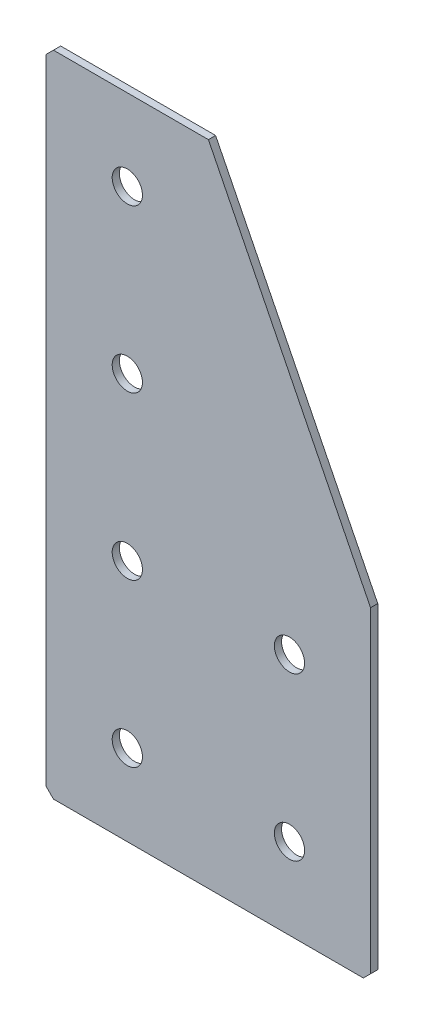
ISO-10303-21;
HEADER;
FILE_DESCRIPTION(('STEP AP214'),'2;1');
FILE_NAME('part.step','',(''),(''),'','','');
FILE_SCHEMA(('AUTOMOTIVE_DESIGN { 1 0 10303 214 1 1 1 1 }'));
ENDSEC;
DATA;
#1=APPLICATION_CONTEXT('core data for automotive mechanical design processes');
#2=APPLICATION_PROTOCOL_DEFINITION('international standard','automotive_design',2000,#1);
#3=PRODUCT_CONTEXT('',#1,'mechanical');
#4=PRODUCT('Part','Part','',(#3));
#5=PRODUCT_RELATED_PRODUCT_CATEGORY('part','',(#4));
#6=PRODUCT_DEFINITION_FORMATION('','',#4);
#7=PRODUCT_DEFINITION_CONTEXT('part definition',#1,'design');
#8=PRODUCT_DEFINITION('design','',#6,#7);
#9=PRODUCT_DEFINITION_SHAPE('','',#8);
#10=(LENGTH_UNIT() NAMED_UNIT(*) SI_UNIT(.MILLI.,.METRE.));
#11=(NAMED_UNIT(*) PLANE_ANGLE_UNIT() SI_UNIT($,.RADIAN.));
#12=(NAMED_UNIT(*) SI_UNIT($,.STERADIAN.) SOLID_ANGLE_UNIT());
#13=UNCERTAINTY_MEASURE_WITH_UNIT(LENGTH_MEASURE(1.E-05),#10,'distance_accuracy_value','');
#14=(GEOMETRIC_REPRESENTATION_CONTEXT(3) GLOBAL_UNCERTAINTY_ASSIGNED_CONTEXT((#13)) GLOBAL_UNIT_ASSIGNED_CONTEXT((#10,
#11,#12)) REPRESENTATION_CONTEXT('',''));
#15=CARTESIAN_POINT('',(0.,0.,0.));
#16=DIRECTION('',(0.,0.,1.));
#17=DIRECTION('',(1.,0.,0.));
#18=AXIS2_PLACEMENT_3D('',#15,#16,#17);
#19=CARTESIAN_POINT('',(0.,0.,-2.));
#20=DIRECTION('',(0.,0.,1.));
#21=DIRECTION('',(1.,0.,0.));
#22=AXIS2_PLACEMENT_3D('',#19,#20,#21);
#23=PLANE('',#22);
#24=CARTESIAN_POINT('',(22.5,-157.5,-2.00000000000001));
#25=DIRECTION('',(0.,0.,-1.));
#26=DIRECTION('',(0.,1.,0.));
#27=AXIS2_PLACEMENT_3D('',#24,#25,#26);
#28=CIRCLE('',#27,4.2);
#29=CARTESIAN_POINT('',(22.5,-153.3,-2.00000000000001));
#30=VERTEX_POINT('',#29);
#31=EDGE_CURVE('E206',#30,#30,#28,.T.);
#32=ORIENTED_EDGE('',*,*,#31,.F.);
#33=EDGE_LOOP('',(#32));
#34=FACE_BOUND('',#33,.T.);
#35=CARTESIAN_POINT('',(22.5,-67.5,-2.));
#36=DIRECTION('',(0.,0.,-1.));
#37=DIRECTION('',(0.,1.,0.));
#38=AXIS2_PLACEMENT_3D('',#35,#36,#37);
#39=CIRCLE('',#38,4.2);
#40=CARTESIAN_POINT('',(22.5,-63.3,-2.));
#41=VERTEX_POINT('',#40);
#42=EDGE_CURVE('E194',#41,#41,#39,.T.);
#43=ORIENTED_EDGE('',*,*,#42,.F.);
#44=EDGE_LOOP('',(#43));
#45=FACE_BOUND('',#44,.T.);
#46=CARTESIAN_POINT('',(22.5,-22.5,-2.));
#47=DIRECTION('',(0.,0.,-1.));
#48=DIRECTION('',(0.,1.,0.));
#49=AXIS2_PLACEMENT_3D('',#46,#47,#48);
#50=CIRCLE('',#49,4.2);
#51=CARTESIAN_POINT('',(22.5,-18.3,-2.));
#52=VERTEX_POINT('',#51);
#53=EDGE_CURVE('E188',#52,#52,#50,.T.);
#54=ORIENTED_EDGE('',*,*,#53,.F.);
#55=EDGE_LOOP('',(#54));
#56=FACE_BOUND('',#55,.T.);
#57=CARTESIAN_POINT('',(67.5,-157.5,-2.00000000000001));
#58=DIRECTION('',(0.,0.,-1.));
#59=DIRECTION('',(0.,1.,0.));
#60=AXIS2_PLACEMENT_3D('',#57,#58,#59);
#61=CIRCLE('',#60,4.2);
#62=CARTESIAN_POINT('',(67.5,-153.3,-2.00000000000001));
#63=VERTEX_POINT('',#62);
#64=EDGE_CURVE('E182',#63,#63,#61,.T.);
#65=ORIENTED_EDGE('',*,*,#64,.F.);
#66=EDGE_LOOP('',(#65));
#67=FACE_BOUND('',#66,.T.);
#68=CARTESIAN_POINT('',(67.5,-112.5,-2.00000000000001));
#69=DIRECTION('',(0.,0.,-1.));
#70=DIRECTION('',(0.,1.,0.));
#71=AXIS2_PLACEMENT_3D('',#68,#69,#70);
#72=CIRCLE('',#71,4.2);
#73=CARTESIAN_POINT('',(67.5,-108.3,-2.00000000000001));
#74=VERTEX_POINT('',#73);
#75=EDGE_CURVE('E176',#74,#74,#72,.T.);
#76=ORIENTED_EDGE('',*,*,#75,.F.);
#77=EDGE_LOOP('',(#76));
#78=FACE_BOUND('',#77,.T.);
#79=DIRECTION('',(0.,1.,0.));
#80=VECTOR('',#79,1.);
#81=CARTESIAN_POINT('',(0.,0.,-2.));
#82=LINE('',#81,#80);
#83=CARTESIAN_POINT('',(0.,-178.,-2.));
#84=VERTEX_POINT('',#83);
#85=CARTESIAN_POINT('',(0.,-2.,-2.));
#86=VERTEX_POINT('',#85);
#87=EDGE_CURVE('E132',#84,#86,#82,.T.);
#88=ORIENTED_EDGE('',*,*,#87,.T.);
#89=DIRECTION('',(-0.707106781186548,-0.707106781186548,0.));
#90=VECTOR('',#89,1.);
#91=CARTESIAN_POINT('',(2.,0.,-2.));
#92=LINE('',#91,#90);
#93=CARTESIAN_POINT('',(2.00000000000002,0.,-2.));
#94=VERTEX_POINT('',#93);
#95=EDGE_CURVE('E108',#86,#94,#92,.F.);
#96=ORIENTED_EDGE('',*,*,#95,.T.);
#97=DIRECTION('',(1.,0.,0.));
#98=VECTOR('',#97,1.);
#99=CARTESIAN_POINT('',(45.,0.,-2.));
#100=LINE('',#99,#98);
#101=CARTESIAN_POINT('',(45.,0.,-2.));
#102=VERTEX_POINT('',#101);
#103=EDGE_CURVE('E101',#94,#102,#100,.T.);
#104=ORIENTED_EDGE('',*,*,#103,.T.);
#105=DIRECTION('',(0.447213595499958,-0.894427190999916,0.));
#106=VECTOR('',#105,1.);
#107=CARTESIAN_POINT('',(90.,-90.,-2.));
#108=LINE('',#107,#106);
#109=CARTESIAN_POINT('',(90.,-90.,-2.));
#110=VERTEX_POINT('',#109);
#111=EDGE_CURVE('E105',#102,#110,#108,.T.);
#112=ORIENTED_EDGE('',*,*,#111,.T.);
#113=DIRECTION('',(0.,-1.,0.));
#114=VECTOR('',#113,1.);
#115=CARTESIAN_POINT('',(90.,-180.,-2.));
#116=LINE('',#115,#114);
#117=CARTESIAN_POINT('',(90.,-178.,-2.));
#118=VERTEX_POINT('',#117);
#119=EDGE_CURVE('E122',#110,#118,#116,.T.);
#120=ORIENTED_EDGE('',*,*,#119,.T.);
#121=DIRECTION('',(0.707106781186548,0.707106781186548,0.));
#122=VECTOR('',#121,1.);
#123=CARTESIAN_POINT('',(88.,-180.,-2.));
#124=LINE('',#123,#122);
#125=CARTESIAN_POINT('',(87.9999999999999,-180.,-2.));
#126=VERTEX_POINT('',#125);
#127=EDGE_CURVE('E59',#118,#126,#124,.F.);
#128=ORIENTED_EDGE('',*,*,#127,.T.);
#129=DIRECTION('',(-1.,0.,0.));
#130=VECTOR('',#129,1.);
#131=CARTESIAN_POINT('',(0.,-180.,-2.));
#132=LINE('',#131,#130);
#133=CARTESIAN_POINT('',(2.,-180.,-2.));
#134=VERTEX_POINT('',#133);
#135=EDGE_CURVE('E155',#126,#134,#132,.T.);
#136=ORIENTED_EDGE('',*,*,#135,.T.);
#137=DIRECTION('',(0.707106781186548,-0.707106781186548,0.));
#138=VECTOR('',#137,1.);
#139=CARTESIAN_POINT('',(0.,-178.,-2.));
#140=LINE('',#139,#138);
#141=EDGE_CURVE('E146',#134,#84,#140,.F.);
#142=ORIENTED_EDGE('',*,*,#141,.T.);
#143=EDGE_LOOP('',(#88,#96,#104,#112,#120,#128,#136,#142));
#144=FACE_BOUND('',#143,.T.);
#145=CARTESIAN_POINT('',(22.5,-112.5,-2.00000000000001));
#146=DIRECTION('',(0.,0.,-1.));
#147=DIRECTION('',(0.,1.,0.));
#148=AXIS2_PLACEMENT_3D('',#145,#146,#147);
#149=CIRCLE('',#148,4.2);
#150=CARTESIAN_POINT('',(22.5,-108.3,-2.00000000000001));
#151=VERTEX_POINT('',#150);
#152=EDGE_CURVE('E200',#151,#151,#149,.T.);
#153=ORIENTED_EDGE('',*,*,#152,.F.);
#154=EDGE_LOOP('',(#153));
#155=FACE_BOUND('',#154,.T.);
#156=ADVANCED_FACE('F37',(#34,#45,#56,#67,#78,#144,#155),#23,.F.);
#157=CARTESIAN_POINT('',(45.,0.,-2.));
#158=DIRECTION('',(0.,-1.,0.));
#159=DIRECTION('',(1.,0.,0.));
#160=AXIS2_PLACEMENT_3D('',#157,#158,#159);
#161=PLANE('',#160);
#162=ORIENTED_EDGE('',*,*,#103,.F.);
#163=DIRECTION('',(0.,0.,1.));
#164=VECTOR('',#163,1.);
#165=CARTESIAN_POINT('',(2.,0.,-2.));
#166=LINE('',#165,#164);
#167=CARTESIAN_POINT('',(2.00000000000002,0.,0.));
#168=VERTEX_POINT('',#167);
#169=EDGE_CURVE('E128',#94,#168,#166,.T.);
#170=ORIENTED_EDGE('',*,*,#169,.T.);
#171=DIRECTION('',(1.,0.,0.));
#172=VECTOR('',#171,1.);
#173=CARTESIAN_POINT('',(45.,0.,0.));
#174=LINE('',#173,#172);
#175=CARTESIAN_POINT('',(45.,0.,0.));
#176=VERTEX_POINT('',#175);
#177=EDGE_CURVE('E126',#168,#176,#174,.T.);
#178=ORIENTED_EDGE('',*,*,#177,.T.);
#179=DIRECTION('',(0.,0.,1.));
#180=VECTOR('',#179,1.);
#181=CARTESIAN_POINT('',(45.,0.,-2.));
#182=LINE('',#181,#180);
#183=EDGE_CURVE('E118',#102,#176,#182,.T.);
#184=ORIENTED_EDGE('',*,*,#183,.F.);
#185=EDGE_LOOP('',(#162,#170,#178,#184));
#186=FACE_BOUND('',#185,.T.);
#187=ADVANCED_FACE('F124',(#186),#161,.F.);
#188=CARTESIAN_POINT('',(90.,-90.,-2.));
#189=DIRECTION('',(-0.894427190999916,-0.447213595499958,0.));
#190=DIRECTION('',(0.447213595499958,-0.894427190999916,0.));
#191=AXIS2_PLACEMENT_3D('',#188,#189,#190);
#192=PLANE('',#191);
#193=DIRECTION('',(0.447213595499958,-0.894427190999916,0.));
#194=VECTOR('',#193,1.);
#195=CARTESIAN_POINT('',(90.,-90.,0.));
#196=LINE('',#195,#194);
#197=CARTESIAN_POINT('',(90.,-90.,0.));
#198=VERTEX_POINT('',#197);
#199=EDGE_CURVE('E165',#176,#198,#196,.T.);
#200=ORIENTED_EDGE('',*,*,#199,.T.);
#201=DIRECTION('',(0.,0.,1.));
#202=VECTOR('',#201,1.);
#203=CARTESIAN_POINT('',(90.,-90.,-2.));
#204=LINE('',#203,#202);
#205=EDGE_CURVE('E120',#110,#198,#204,.T.);
#206=ORIENTED_EDGE('',*,*,#205,.F.);
#207=ORIENTED_EDGE('',*,*,#111,.F.);
#208=ORIENTED_EDGE('',*,*,#183,.T.);
#209=EDGE_LOOP('',(#200,#206,#207,#208));
#210=FACE_BOUND('',#209,.T.);
#211=ADVANCED_FACE('F117',(#210),#192,.F.);
#212=CARTESIAN_POINT('',(90.,-180.,-2.));
#213=DIRECTION('',(-1.,0.,0.));
#214=DIRECTION('',(0.,-1.,0.));
#215=AXIS2_PLACEMENT_3D('',#212,#213,#214);
#216=PLANE('',#215);
#217=DIRECTION('',(0.,-1.,0.));
#218=VECTOR('',#217,1.);
#219=CARTESIAN_POINT('',(90.,-180.,0.));
#220=LINE('',#219,#218);
#221=CARTESIAN_POINT('',(90.,-178.,0.));
#222=VERTEX_POINT('',#221);
#223=EDGE_CURVE('E162',#198,#222,#220,.T.);
#224=ORIENTED_EDGE('',*,*,#223,.T.);
#225=DIRECTION('',(0.,0.,-1.));
#226=VECTOR('',#225,1.);
#227=CARTESIAN_POINT('',(90.,-178.,-2.));
#228=LINE('',#227,#226);
#229=EDGE_CURVE('E11',#222,#118,#228,.T.);
#230=ORIENTED_EDGE('',*,*,#229,.T.);
#231=ORIENTED_EDGE('',*,*,#119,.F.);
#232=ORIENTED_EDGE('',*,*,#205,.T.);
#233=EDGE_LOOP('',(#224,#230,#231,#232));
#234=FACE_BOUND('',#233,.T.);
#235=ADVANCED_FACE('F245',(#234),#216,.F.);
#236=CARTESIAN_POINT('',(0.,-180.,-2.));
#237=DIRECTION('',(0.,1.,0.));
#238=DIRECTION('',(0.,0.,1.));
#239=AXIS2_PLACEMENT_3D('',#236,#237,#238);
#240=PLANE('',#239);
#241=ORIENTED_EDGE('',*,*,#135,.F.);
#242=DIRECTION('',(0.,0.,1.));
#243=VECTOR('',#242,1.);
#244=CARTESIAN_POINT('',(88.,-180.,-2.));
#245=LINE('',#244,#243);
#246=CARTESIAN_POINT('',(87.9999999999999,-180.,0.));
#247=VERTEX_POINT('',#246);
#248=EDGE_CURVE('E45',#126,#247,#245,.T.);
#249=ORIENTED_EDGE('',*,*,#248,.T.);
#250=DIRECTION('',(-1.,0.,0.));
#251=VECTOR('',#250,1.);
#252=CARTESIAN_POINT('',(0.,-180.,0.));
#253=LINE('',#252,#251);
#254=CARTESIAN_POINT('',(2.,-180.,0.));
#255=VERTEX_POINT('',#254);
#256=EDGE_CURVE('E154',#247,#255,#253,.T.);
#257=ORIENTED_EDGE('',*,*,#256,.T.);
#258=DIRECTION('',(0.,0.,-1.));
#259=VECTOR('',#258,1.);
#260=CARTESIAN_POINT('',(2.,-180.,-2.));
#261=LINE('',#260,#259);
#262=EDGE_CURVE('E52',#255,#134,#261,.T.);
#263=ORIENTED_EDGE('',*,*,#262,.T.);
#264=EDGE_LOOP('',(#241,#249,#257,#263));
#265=FACE_BOUND('',#264,.T.);
#266=ADVANCED_FACE('F153',(#265),#240,.F.);
#267=CARTESIAN_POINT('',(0.,0.,-2.));
#268=DIRECTION('',(1.,0.,0.));
#269=DIRECTION('',(0.,0.,-1.));
#270=AXIS2_PLACEMENT_3D('',#267,#268,#269);
#271=PLANE('',#270);
#272=DIRECTION('',(0.,1.,0.));
#273=VECTOR('',#272,1.);
#274=CARTESIAN_POINT('',(0.,0.,0.));
#275=LINE('',#274,#273);
#276=CARTESIAN_POINT('',(0.,-178.,0.));
#277=VERTEX_POINT('',#276);
#278=CARTESIAN_POINT('',(0.,-2.,0.));
#279=VERTEX_POINT('',#278);
#280=EDGE_CURVE('E113',#277,#279,#275,.T.);
#281=ORIENTED_EDGE('',*,*,#280,.T.);
#282=DIRECTION('',(0.,0.,-1.));
#283=VECTOR('',#282,1.);
#284=CARTESIAN_POINT('',(0.,-2.,-2.));
#285=LINE('',#284,#283);
#286=EDGE_CURVE('E144',#279,#86,#285,.T.);
#287=ORIENTED_EDGE('',*,*,#286,.T.);
#288=ORIENTED_EDGE('',*,*,#87,.F.);
#289=DIRECTION('',(0.,0.,1.));
#290=VECTOR('',#289,1.);
#291=CARTESIAN_POINT('',(0.,-178.,-2.));
#292=LINE('',#291,#290);
#293=EDGE_CURVE('E141',#84,#277,#292,.T.);
#294=ORIENTED_EDGE('',*,*,#293,.T.);
#295=EDGE_LOOP('',(#281,#287,#288,#294));
#296=FACE_BOUND('',#295,.T.);
#297=ADVANCED_FACE('F232',(#296),#271,.F.);
#298=CARTESIAN_POINT('',(0.,0.,0.));
#299=DIRECTION('',(0.,0.,1.));
#300=DIRECTION('',(1.,0.,0.));
#301=AXIS2_PLACEMENT_3D('',#298,#299,#300);
#302=PLANE('',#301);
#303=CARTESIAN_POINT('',(22.5,-157.5,0.));
#304=DIRECTION('',(0.,0.,1.));
#305=DIRECTION('',(1.,0.,0.));
#306=AXIS2_PLACEMENT_3D('',#303,#304,#305);
#307=CIRCLE('',#306,4.2);
#308=CARTESIAN_POINT('',(26.7,-157.5,0.));
#309=VERTEX_POINT('',#308);
#310=EDGE_CURVE('E203',#309,#309,#307,.T.);
#311=ORIENTED_EDGE('',*,*,#310,.F.);
#312=EDGE_LOOP('',(#311));
#313=FACE_BOUND('',#312,.T.);
#314=CARTESIAN_POINT('',(22.5,-112.5,0.));
#315=DIRECTION('',(0.,0.,1.));
#316=DIRECTION('',(1.,0.,0.));
#317=AXIS2_PLACEMENT_3D('',#314,#315,#316);
#318=CIRCLE('',#317,4.2);
#319=CARTESIAN_POINT('',(26.7,-112.5,0.));
#320=VERTEX_POINT('',#319);
#321=EDGE_CURVE('E197',#320,#320,#318,.T.);
#322=ORIENTED_EDGE('',*,*,#321,.F.);
#323=EDGE_LOOP('',(#322));
#324=FACE_BOUND('',#323,.T.);
#325=CARTESIAN_POINT('',(22.5,-67.5,0.));
#326=DIRECTION('',(0.,0.,1.));
#327=DIRECTION('',(1.,0.,0.));
#328=AXIS2_PLACEMENT_3D('',#325,#326,#327);
#329=CIRCLE('',#328,4.2);
#330=CARTESIAN_POINT('',(26.7,-67.5,0.));
#331=VERTEX_POINT('',#330);
#332=EDGE_CURVE('E191',#331,#331,#329,.T.);
#333=ORIENTED_EDGE('',*,*,#332,.F.);
#334=EDGE_LOOP('',(#333));
#335=FACE_BOUND('',#334,.T.);
#336=CARTESIAN_POINT('',(22.5,-22.5,0.));
#337=DIRECTION('',(0.,0.,1.));
#338=DIRECTION('',(1.,0.,0.));
#339=AXIS2_PLACEMENT_3D('',#336,#337,#338);
#340=CIRCLE('',#339,4.2);
#341=CARTESIAN_POINT('',(26.7,-22.5,0.));
#342=VERTEX_POINT('',#341);
#343=EDGE_CURVE('E185',#342,#342,#340,.T.);
#344=ORIENTED_EDGE('',*,*,#343,.F.);
#345=EDGE_LOOP('',(#344));
#346=FACE_BOUND('',#345,.T.);
#347=CARTESIAN_POINT('',(67.5,-157.5,0.));
#348=DIRECTION('',(0.,0.,1.));
#349=DIRECTION('',(1.,0.,0.));
#350=AXIS2_PLACEMENT_3D('',#347,#348,#349);
#351=CIRCLE('',#350,4.2);
#352=CARTESIAN_POINT('',(71.7,-157.5,0.));
#353=VERTEX_POINT('',#352);
#354=EDGE_CURVE('E179',#353,#353,#351,.T.);
#355=ORIENTED_EDGE('',*,*,#354,.F.);
#356=EDGE_LOOP('',(#355));
#357=FACE_BOUND('',#356,.T.);
#358=CARTESIAN_POINT('',(67.5,-112.5,0.));
#359=DIRECTION('',(0.,0.,1.));
#360=DIRECTION('',(1.,0.,0.));
#361=AXIS2_PLACEMENT_3D('',#358,#359,#360);
#362=CIRCLE('',#361,4.2);
#363=CARTESIAN_POINT('',(71.7,-112.5,0.));
#364=VERTEX_POINT('',#363);
#365=EDGE_CURVE('E170',#364,#364,#362,.T.);
#366=ORIENTED_EDGE('',*,*,#365,.F.);
#367=EDGE_LOOP('',(#366));
#368=FACE_BOUND('',#367,.T.);
#369=ORIENTED_EDGE('',*,*,#177,.F.);
#370=DIRECTION('',(0.707106781186548,0.707106781186548,0.));
#371=VECTOR('',#370,1.);
#372=CARTESIAN_POINT('',(1.,-1.,0.));
#373=LINE('',#372,#371);
#374=EDGE_CURVE('E139',#168,#279,#373,.F.);
#375=ORIENTED_EDGE('',*,*,#374,.T.);
#376=ORIENTED_EDGE('',*,*,#280,.F.);
#377=DIRECTION('',(-0.707106781186548,0.707106781186548,0.));
#378=VECTOR('',#377,1.);
#379=CARTESIAN_POINT('',(-89.,-89.,0.));
#380=LINE('',#379,#378);
#381=EDGE_CURVE('E130',#277,#255,#380,.F.);
#382=ORIENTED_EDGE('',*,*,#381,.T.);
#383=ORIENTED_EDGE('',*,*,#256,.F.);
#384=DIRECTION('',(-0.707106781186548,-0.707106781186548,0.));
#385=VECTOR('',#384,1.);
#386=CARTESIAN_POINT('',(134.,-134.,0.));
#387=LINE('',#386,#385);
#388=EDGE_CURVE('E137',#247,#222,#387,.F.);
#389=ORIENTED_EDGE('',*,*,#388,.T.);
#390=ORIENTED_EDGE('',*,*,#223,.F.);
#391=ORIENTED_EDGE('',*,*,#199,.F.);
#392=EDGE_LOOP('',(#369,#375,#376,#382,#383,#389,#390,#391));
#393=FACE_BOUND('',#392,.T.);
#394=ADVANCED_FACE('F158',(#313,#324,#335,#346,#357,#368,#393),#302,.T.);
#395=CARTESIAN_POINT('',(67.5,-112.5,-2.00000000000001));
#396=DIRECTION('',(0.,0.,-1.));
#397=DIRECTION('',(0.,1.,0.));
#398=AXIS2_PLACEMENT_3D('',#395,#396,#397);
#399=CYLINDRICAL_SURFACE('',#398,4.2);
#400=ORIENTED_EDGE('',*,*,#75,.T.);
#401=EDGE_LOOP('',(#400));
#402=FACE_BOUND('',#401,.T.);
#403=ORIENTED_EDGE('',*,*,#365,.T.);
#404=EDGE_LOOP('',(#403));
#405=FACE_BOUND('',#404,.T.);
#406=ADVANCED_FACE('F224',(#402,#405),#399,.F.);
#407=CARTESIAN_POINT('',(67.5,-157.5,-2.00000000000001));
#408=DIRECTION('',(0.,0.,-1.));
#409=DIRECTION('',(0.,1.,0.));
#410=AXIS2_PLACEMENT_3D('',#407,#408,#409);
#411=CYLINDRICAL_SURFACE('',#410,4.2);
#412=ORIENTED_EDGE('',*,*,#64,.T.);
#413=EDGE_LOOP('',(#412));
#414=FACE_BOUND('',#413,.T.);
#415=ORIENTED_EDGE('',*,*,#354,.T.);
#416=EDGE_LOOP('',(#415));
#417=FACE_BOUND('',#416,.T.);
#418=ADVANCED_FACE('F227',(#414,#417),#411,.F.);
#419=CARTESIAN_POINT('',(22.5,-22.5,-2.));
#420=DIRECTION('',(0.,0.,-1.));
#421=DIRECTION('',(0.,1.,0.));
#422=AXIS2_PLACEMENT_3D('',#419,#420,#421);
#423=CYLINDRICAL_SURFACE('',#422,4.2);
#424=ORIENTED_EDGE('',*,*,#53,.T.);
#425=EDGE_LOOP('',(#424));
#426=FACE_BOUND('',#425,.T.);
#427=ORIENTED_EDGE('',*,*,#343,.T.);
#428=EDGE_LOOP('',(#427));
#429=FACE_BOUND('',#428,.T.);
#430=ADVANCED_FACE('F343',(#426,#429),#423,.F.);
#431=CARTESIAN_POINT('',(22.5,-67.5,-2.));
#432=DIRECTION('',(0.,0.,-1.));
#433=DIRECTION('',(0.,1.,0.));
#434=AXIS2_PLACEMENT_3D('',#431,#432,#433);
#435=CYLINDRICAL_SURFACE('',#434,4.2);
#436=ORIENTED_EDGE('',*,*,#42,.T.);
#437=EDGE_LOOP('',(#436));
#438=FACE_BOUND('',#437,.T.);
#439=ORIENTED_EDGE('',*,*,#332,.T.);
#440=EDGE_LOOP('',(#439));
#441=FACE_BOUND('',#440,.T.);
#442=ADVANCED_FACE('F333',(#438,#441),#435,.F.);
#443=CARTESIAN_POINT('',(22.5,-112.5,-2.00000000000001));
#444=DIRECTION('',(0.,0.,-1.));
#445=DIRECTION('',(0.,1.,0.));
#446=AXIS2_PLACEMENT_3D('',#443,#444,#445);
#447=CYLINDRICAL_SURFACE('',#446,4.2);
#448=ORIENTED_EDGE('',*,*,#152,.T.);
#449=EDGE_LOOP('',(#448));
#450=FACE_BOUND('',#449,.T.);
#451=ORIENTED_EDGE('',*,*,#321,.T.);
#452=EDGE_LOOP('',(#451));
#453=FACE_BOUND('',#452,.T.);
#454=ADVANCED_FACE('F324',(#450,#453),#447,.F.);
#455=CARTESIAN_POINT('',(22.5,-157.5,-2.00000000000001));
#456=DIRECTION('',(0.,0.,-1.));
#457=DIRECTION('',(0.,1.,0.));
#458=AXIS2_PLACEMENT_3D('',#455,#456,#457);
#459=CYLINDRICAL_SURFACE('',#458,4.2);
#460=ORIENTED_EDGE('',*,*,#31,.T.);
#461=EDGE_LOOP('',(#460));
#462=FACE_BOUND('',#461,.T.);
#463=ORIENTED_EDGE('',*,*,#310,.T.);
#464=EDGE_LOOP('',(#463));
#465=FACE_BOUND('',#464,.T.);
#466=ADVANCED_FACE('F210',(#462,#465),#459,.F.);
#467=CARTESIAN_POINT('',(2.,0.,-2.));
#468=DIRECTION('',(0.707106781186547,-0.707106781186547,0.));
#469=DIRECTION('',(0.,0.,1.));
#470=AXIS2_PLACEMENT_3D('',#467,#468,#469);
#471=PLANE('',#470);
#472=ORIENTED_EDGE('',*,*,#95,.F.);
#473=ORIENTED_EDGE('',*,*,#286,.F.);
#474=ORIENTED_EDGE('',*,*,#374,.F.);
#475=ORIENTED_EDGE('',*,*,#169,.F.);
#476=EDGE_LOOP('',(#472,#473,#474,#475));
#477=FACE_BOUND('',#476,.T.);
#478=ADVANCED_FACE('F253',(#477),#471,.F.);
#479=CARTESIAN_POINT('',(88.,-180.,-2.));
#480=DIRECTION('',(-0.707106781186547,0.707106781186547,0.));
#481=DIRECTION('',(0.,0.,1.));
#482=AXIS2_PLACEMENT_3D('',#479,#480,#481);
#483=PLANE('',#482);
#484=ORIENTED_EDGE('',*,*,#127,.F.);
#485=ORIENTED_EDGE('',*,*,#229,.F.);
#486=ORIENTED_EDGE('',*,*,#388,.F.);
#487=ORIENTED_EDGE('',*,*,#248,.F.);
#488=EDGE_LOOP('',(#484,#485,#486,#487));
#489=FACE_BOUND('',#488,.T.);
#490=ADVANCED_FACE('F255',(#489),#483,.F.);
#491=CARTESIAN_POINT('',(0.,-178.,-2.));
#492=DIRECTION('',(0.707106781186547,0.707106781186547,0.));
#493=DIRECTION('',(0.,0.,1.));
#494=AXIS2_PLACEMENT_3D('',#491,#492,#493);
#495=PLANE('',#494);
#496=ORIENTED_EDGE('',*,*,#141,.F.);
#497=ORIENTED_EDGE('',*,*,#262,.F.);
#498=ORIENTED_EDGE('',*,*,#381,.F.);
#499=ORIENTED_EDGE('',*,*,#293,.F.);
#500=EDGE_LOOP('',(#496,#497,#498,#499));
#501=FACE_BOUND('',#500,.T.);
#502=ADVANCED_FACE('F39',(#501),#495,.F.);
#503=CLOSED_SHELL('',(#156,#187,#211,#235,#266,#297,#394,#406,#418,#430,#442,#454,#466,#478,
#490,#502));
#504=MANIFOLD_SOLID_BREP('B2',#503);
#505=ADVANCED_BREP_SHAPE_REPRESENTATION('',(#18,#504),#14);
#506=SHAPE_DEFINITION_REPRESENTATION(#9,#505);
ENDSEC;
END-ISO-10303-21;
